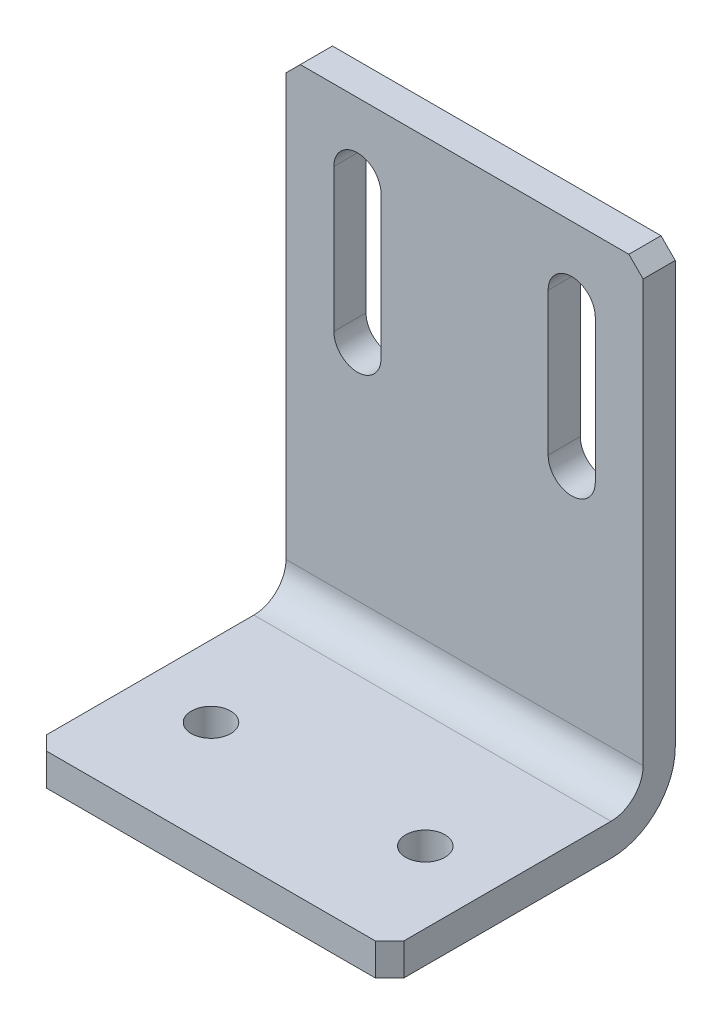
ISO-10303-21;
HEADER;
FILE_DESCRIPTION(('STEP AP214'),'2;1');
FILE_NAME('part.step','',(''),(''),'','','');
FILE_SCHEMA(('AUTOMOTIVE_DESIGN { 1 0 10303 214 1 1 1 1 }'));
ENDSEC;
DATA;
#1=APPLICATION_CONTEXT('core data for automotive mechanical design processes');
#2=APPLICATION_PROTOCOL_DEFINITION('international standard','automotive_design',2000,#1);
#3=PRODUCT_CONTEXT('',#1,'mechanical');
#4=PRODUCT('Part','Part','',(#3));
#5=PRODUCT_RELATED_PRODUCT_CATEGORY('part','',(#4));
#6=PRODUCT_DEFINITION_FORMATION('','',#4);
#7=PRODUCT_DEFINITION_CONTEXT('part definition',#1,'design');
#8=PRODUCT_DEFINITION('design','',#6,#7);
#9=PRODUCT_DEFINITION_SHAPE('','',#8);
#10=(LENGTH_UNIT() NAMED_UNIT(*) SI_UNIT(.MILLI.,.METRE.));
#11=(NAMED_UNIT(*) PLANE_ANGLE_UNIT() SI_UNIT($,.RADIAN.));
#12=(NAMED_UNIT(*) SI_UNIT($,.STERADIAN.) SOLID_ANGLE_UNIT());
#13=UNCERTAINTY_MEASURE_WITH_UNIT(LENGTH_MEASURE(1.E-05),#10,'distance_accuracy_value','');
#14=(GEOMETRIC_REPRESENTATION_CONTEXT(3) GLOBAL_UNCERTAINTY_ASSIGNED_CONTEXT((#13)) GLOBAL_UNIT_ASSIGNED_CONTEXT((#10,
#11,#12)) REPRESENTATION_CONTEXT('',''));
#15=CARTESIAN_POINT('',(0.,0.,0.));
#16=DIRECTION('',(0.,0.,1.));
#17=DIRECTION('',(1.,0.,0.));
#18=AXIS2_PLACEMENT_3D('',#15,#16,#17);
#19=CARTESIAN_POINT('',(25.,4.5,4.5));
#20=DIRECTION('',(0.,0.,-1.));
#21=DIRECTION('',(0.,1.,0.));
#22=AXIS2_PLACEMENT_3D('',#19,#20,#21);
#23=PLANE('',#22);
#24=DIRECTION('',(0.,-1.,0.));
#25=VECTOR('',#24,1.);
#26=CARTESIAN_POINT('',(11.7,60.,4.5));
#27=LINE('',#26,#25);
#28=CARTESIAN_POINT('',(11.7,60.,4.5));
#29=VERTEX_POINT('',#28);
#30=CARTESIAN_POINT('',(11.7,40.,4.5));
#31=VERTEX_POINT('',#30);
#32=EDGE_CURVE('E208',#29,#31,#27,.T.);
#33=ORIENTED_EDGE('',*,*,#32,.F.);
#34=CARTESIAN_POINT('',(15.,60.,4.5));
#35=DIRECTION('',(0.,0.,1.));
#36=DIRECTION('',(1.,0.,0.));
#37=AXIS2_PLACEMENT_3D('',#34,#35,#36);
#38=CIRCLE('',#37,3.30000000000001);
#39=CARTESIAN_POINT('',(18.3,60.,4.5));
#40=VERTEX_POINT('',#39);
#41=EDGE_CURVE('E181',#40,#29,#38,.T.);
#42=ORIENTED_EDGE('',*,*,#41,.F.);
#43=DIRECTION('',(0.,1.,0.));
#44=VECTOR('',#43,1.);
#45=CARTESIAN_POINT('',(18.3,60.,4.5));
#46=LINE('',#45,#44);
#47=CARTESIAN_POINT('',(18.3,40.,4.5));
#48=VERTEX_POINT('',#47);
#49=EDGE_CURVE('E199',#48,#40,#46,.T.);
#50=ORIENTED_EDGE('',*,*,#49,.F.);
#51=CARTESIAN_POINT('',(15.,40.,4.5));
#52=DIRECTION('',(0.,0.,1.));
#53=DIRECTION('',(1.,0.,0.));
#54=AXIS2_PLACEMENT_3D('',#51,#52,#53);
#55=CIRCLE('',#54,3.30000000000001);
#56=EDGE_CURVE('E202',#31,#48,#55,.T.);
#57=ORIENTED_EDGE('',*,*,#56,.F.);
#58=EDGE_LOOP('',(#33,#42,#50,#57));
#59=FACE_BOUND('',#58,.T.);
#60=DIRECTION('',(0.,-1.,0.));
#61=VECTOR('',#60,1.);
#62=CARTESIAN_POINT('',(-18.3,60.,4.5));
#63=LINE('',#62,#61);
#64=CARTESIAN_POINT('',(-18.3,60.,4.5));
#65=VERTEX_POINT('',#64);
#66=CARTESIAN_POINT('',(-18.3,40.,4.5));
#67=VERTEX_POINT('',#66);
#68=EDGE_CURVE('E233',#65,#67,#63,.T.);
#69=ORIENTED_EDGE('',*,*,#68,.F.);
#70=CARTESIAN_POINT('',(-15.,60.,4.5));
#71=DIRECTION('',(0.,0.,1.));
#72=DIRECTION('',(1.,0.,0.));
#73=AXIS2_PLACEMENT_3D('',#70,#71,#72);
#74=CIRCLE('',#73,3.3);
#75=CARTESIAN_POINT('',(-11.7,60.,4.5));
#76=VERTEX_POINT('',#75);
#77=EDGE_CURVE('E214',#76,#65,#74,.T.);
#78=ORIENTED_EDGE('',*,*,#77,.F.);
#79=DIRECTION('',(0.,1.,0.));
#80=VECTOR('',#79,1.);
#81=CARTESIAN_POINT('',(-11.7,60.,4.5));
#82=LINE('',#81,#80);
#83=CARTESIAN_POINT('',(-11.7,40.,4.5));
#84=VERTEX_POINT('',#83);
#85=EDGE_CURVE('E222',#84,#76,#82,.T.);
#86=ORIENTED_EDGE('',*,*,#85,.F.);
#87=CARTESIAN_POINT('',(-15.,40.,4.5));
#88=DIRECTION('',(0.,0.,1.));
#89=DIRECTION('',(1.,0.,0.));
#90=AXIS2_PLACEMENT_3D('',#87,#88,#89);
#91=CIRCLE('',#90,3.3);
#92=EDGE_CURVE('E236',#67,#84,#91,.T.);
#93=ORIENTED_EDGE('',*,*,#92,.F.);
#94=EDGE_LOOP('',(#69,#78,#86,#93));
#95=FACE_BOUND('',#94,.T.);
#96=DIRECTION('',(0.,-1.,0.));
#97=VECTOR('',#96,1.);
#98=CARTESIAN_POINT('',(25.,4.5,4.5));
#99=LINE('',#98,#97);
#100=CARTESIAN_POINT('',(25.,68.,4.5));
#101=VERTEX_POINT('',#100);
#102=CARTESIAN_POINT('',(25.,9.,4.5));
#103=VERTEX_POINT('',#102);
#104=EDGE_CURVE('E262',#101,#103,#99,.T.);
#105=ORIENTED_EDGE('',*,*,#104,.F.);
#106=DIRECTION('',(-0.70710678118655,0.707106781186545,0.));
#107=VECTOR('',#106,1.);
#108=CARTESIAN_POINT('',(25.,68.,4.5));
#109=LINE('',#108,#107);
#110=CARTESIAN_POINT('',(23.,70.,4.5));
#111=VERTEX_POINT('',#110);
#112=EDGE_CURVE('E338',#101,#111,#109,.T.);
#113=ORIENTED_EDGE('',*,*,#112,.T.);
#114=DIRECTION('',(-1.,0.,0.));
#115=VECTOR('',#114,1.);
#116=CARTESIAN_POINT('',(25.,70.,4.5));
#117=LINE('',#116,#115);
#118=CARTESIAN_POINT('',(-23.,70.,4.5));
#119=VERTEX_POINT('',#118);
#120=EDGE_CURVE('E273',#111,#119,#117,.T.);
#121=ORIENTED_EDGE('',*,*,#120,.T.);
#122=DIRECTION('',(0.707106781186545,0.70710678118655,0.));
#123=VECTOR('',#122,1.);
#124=CARTESIAN_POINT('',(-23.,70.,4.5));
#125=LINE('',#124,#123);
#126=CARTESIAN_POINT('',(-25.,68.,4.5));
#127=VERTEX_POINT('',#126);
#128=EDGE_CURVE('E336',#119,#127,#125,.F.);
#129=ORIENTED_EDGE('',*,*,#128,.T.);
#130=DIRECTION('',(0.,-1.,0.));
#131=VECTOR('',#130,1.);
#132=CARTESIAN_POINT('',(-25.,4.5,4.5));
#133=LINE('',#132,#131);
#134=CARTESIAN_POINT('',(-25.,9.,4.5));
#135=VERTEX_POINT('',#134);
#136=EDGE_CURVE('E261',#127,#135,#133,.T.);
#137=ORIENTED_EDGE('',*,*,#136,.T.);
#138=DIRECTION('',(-1.,0.,0.));
#139=VECTOR('',#138,1.);
#140=CARTESIAN_POINT('',(25.,9.,4.5));
#141=LINE('',#140,#139);
#142=EDGE_CURVE('E294',#135,#103,#141,.F.);
#143=ORIENTED_EDGE('',*,*,#142,.T.);
#144=EDGE_LOOP('',(#105,#113,#121,#129,#137,#143));
#145=FACE_BOUND('',#144,.T.);
#146=ADVANCED_FACE('F37',(#59,#95,#145),#23,.F.);
#147=CARTESIAN_POINT('',(25.,4.5,4.5));
#148=DIRECTION('',(0.,-1.,0.));
#149=DIRECTION('',(0.,0.,-1.));
#150=AXIS2_PLACEMENT_3D('',#147,#148,#149);
#151=PLANE('',#150);
#152=CARTESIAN_POINT('',(-15.,4.5,25.));
#153=DIRECTION('',(0.,1.,0.));
#154=DIRECTION('',(0.,0.,1.));
#155=AXIS2_PLACEMENT_3D('',#152,#153,#154);
#156=CIRCLE('',#155,2.75);
#157=CARTESIAN_POINT('',(-15.,4.5,27.75));
#158=VERTEX_POINT('',#157);
#159=EDGE_CURVE('E243',#158,#158,#156,.T.);
#160=ORIENTED_EDGE('',*,*,#159,.F.);
#161=EDGE_LOOP('',(#160));
#162=FACE_BOUND('',#161,.T.);
#163=CARTESIAN_POINT('',(15.,4.5,25.));
#164=DIRECTION('',(0.,1.,0.));
#165=DIRECTION('',(0.,0.,1.));
#166=AXIS2_PLACEMENT_3D('',#163,#164,#165);
#167=CIRCLE('',#166,2.75);
#168=CARTESIAN_POINT('',(15.,4.5,27.75));
#169=VERTEX_POINT('',#168);
#170=EDGE_CURVE('E255',#169,#169,#167,.T.);
#171=ORIENTED_EDGE('',*,*,#170,.F.);
#172=EDGE_LOOP('',(#171));
#173=FACE_BOUND('',#172,.T.);
#174=DIRECTION('',(0.,0.,1.));
#175=VECTOR('',#174,1.);
#176=CARTESIAN_POINT('',(-25.,4.5,4.5));
#177=LINE('',#176,#175);
#178=CARTESIAN_POINT('',(-25.,4.5,9.));
#179=VERTEX_POINT('',#178);
#180=CARTESIAN_POINT('',(-25.,4.5,38.));
#181=VERTEX_POINT('',#180);
#182=EDGE_CURVE('E275',#179,#181,#177,.T.);
#183=ORIENTED_EDGE('',*,*,#182,.T.);
#184=DIRECTION('',(-0.707106781186547,0.,-0.707106781186548));
#185=VECTOR('',#184,1.);
#186=CARTESIAN_POINT('',(-23.,4.5,40.));
#187=LINE('',#186,#185);
#188=CARTESIAN_POINT('',(-23.,4.5,40.));
#189=VERTEX_POINT('',#188);
#190=EDGE_CURVE('E328',#181,#189,#187,.F.);
#191=ORIENTED_EDGE('',*,*,#190,.T.);
#192=DIRECTION('',(-1.,0.,0.));
#193=VECTOR('',#192,1.);
#194=CARTESIAN_POINT('',(25.,4.5,40.));
#195=LINE('',#194,#193);
#196=CARTESIAN_POINT('',(23.,4.5,40.));
#197=VERTEX_POINT('',#196);
#198=EDGE_CURVE('E288',#197,#189,#195,.T.);
#199=ORIENTED_EDGE('',*,*,#198,.F.);
#200=DIRECTION('',(0.707106781186552,0.,-0.707106781186543));
#201=VECTOR('',#200,1.);
#202=CARTESIAN_POINT('',(25.,4.5,38.));
#203=LINE('',#202,#201);
#204=CARTESIAN_POINT('',(25.,4.5,38.));
#205=VERTEX_POINT('',#204);
#206=EDGE_CURVE('E326',#197,#205,#203,.T.);
#207=ORIENTED_EDGE('',*,*,#206,.T.);
#208=DIRECTION('',(0.,0.,1.));
#209=VECTOR('',#208,1.);
#210=CARTESIAN_POINT('',(25.,4.5,4.5));
#211=LINE('',#210,#209);
#212=CARTESIAN_POINT('',(25.,4.5,9.));
#213=VERTEX_POINT('',#212);
#214=EDGE_CURVE('E264',#213,#205,#211,.T.);
#215=ORIENTED_EDGE('',*,*,#214,.F.);
#216=DIRECTION('',(-1.,0.,0.));
#217=VECTOR('',#216,1.);
#218=CARTESIAN_POINT('',(-25.,4.5,9.));
#219=LINE('',#218,#217);
#220=EDGE_CURVE('E291',#213,#179,#219,.T.);
#221=ORIENTED_EDGE('',*,*,#220,.T.);
#222=EDGE_LOOP('',(#183,#191,#199,#207,#215,#221));
#223=FACE_BOUND('',#222,.T.);
#224=ADVANCED_FACE('F373',(#162,#173,#223),#151,.F.);
#225=CARTESIAN_POINT('',(25.,0.,40.));
#226=DIRECTION('',(0.,0.,-1.));
#227=DIRECTION('',(0.,1.,0.));
#228=AXIS2_PLACEMENT_3D('',#225,#226,#227);
#229=PLANE('',#228);
#230=ORIENTED_EDGE('',*,*,#198,.T.);
#231=DIRECTION('',(0.,-1.,0.));
#232=VECTOR('',#231,1.);
#233=CARTESIAN_POINT('',(-23.,0.,40.));
#234=LINE('',#233,#232);
#235=CARTESIAN_POINT('',(-23.,0.,40.));
#236=VERTEX_POINT('',#235);
#237=EDGE_CURVE('E315',#189,#236,#234,.T.);
#238=ORIENTED_EDGE('',*,*,#237,.T.);
#239=DIRECTION('',(-1.,0.,0.));
#240=VECTOR('',#239,1.);
#241=CARTESIAN_POINT('',(25.,0.,40.));
#242=LINE('',#241,#240);
#243=CARTESIAN_POINT('',(23.,0.,40.));
#244=VERTEX_POINT('',#243);
#245=EDGE_CURVE('E285',#244,#236,#242,.T.);
#246=ORIENTED_EDGE('',*,*,#245,.F.);
#247=DIRECTION('',(0.,1.,0.));
#248=VECTOR('',#247,1.);
#249=CARTESIAN_POINT('',(23.,4.5,40.));
#250=LINE('',#249,#248);
#251=EDGE_CURVE('E313',#244,#197,#250,.T.);
#252=ORIENTED_EDGE('',*,*,#251,.T.);
#253=EDGE_LOOP('',(#230,#238,#246,#252));
#254=FACE_BOUND('',#253,.T.);
#255=ADVANCED_FACE('F380',(#254),#229,.F.);
#256=CARTESIAN_POINT('',(25.,0.,0.));
#257=DIRECTION('',(0.,1.,0.));
#258=DIRECTION('',(0.,0.,1.));
#259=AXIS2_PLACEMENT_3D('',#256,#257,#258);
#260=PLANE('',#259);
#261=CARTESIAN_POINT('',(-15.,0.,25.));
#262=DIRECTION('',(0.,1.,0.));
#263=DIRECTION('',(0.,0.,1.));
#264=AXIS2_PLACEMENT_3D('',#261,#262,#263);
#265=CIRCLE('',#264,2.75);
#266=CARTESIAN_POINT('',(-15.,0.,27.75));
#267=VERTEX_POINT('',#266);
#268=EDGE_CURVE('E252',#267,#267,#265,.T.);
#269=ORIENTED_EDGE('',*,*,#268,.T.);
#270=EDGE_LOOP('',(#269));
#271=FACE_BOUND('',#270,.T.);
#272=CARTESIAN_POINT('',(15.,0.,25.));
#273=DIRECTION('',(0.,1.,0.));
#274=DIRECTION('',(0.,0.,1.));
#275=AXIS2_PLACEMENT_3D('',#272,#273,#274);
#276=CIRCLE('',#275,2.75);
#277=CARTESIAN_POINT('',(15.,0.,27.75));
#278=VERTEX_POINT('',#277);
#279=EDGE_CURVE('E258',#278,#278,#276,.T.);
#280=ORIENTED_EDGE('',*,*,#279,.T.);
#281=EDGE_LOOP('',(#280));
#282=FACE_BOUND('',#281,.T.);
#283=ORIENTED_EDGE('',*,*,#245,.T.);
#284=DIRECTION('',(0.707106781186547,0.,0.707106781186548));
#285=VECTOR('',#284,1.);
#286=CARTESIAN_POINT('',(-23.,0.,40.));
#287=LINE('',#286,#285);
#288=CARTESIAN_POINT('',(-25.,0.,38.));
#289=VERTEX_POINT('',#288);
#290=EDGE_CURVE('E320',#236,#289,#287,.F.);
#291=ORIENTED_EDGE('',*,*,#290,.T.);
#292=DIRECTION('',(0.,0.,-1.));
#293=VECTOR('',#292,1.);
#294=CARTESIAN_POINT('',(-25.,0.,0.));
#295=LINE('',#294,#293);
#296=CARTESIAN_POINT('',(-25.,0.,9.));
#297=VERTEX_POINT('',#296);
#298=EDGE_CURVE('E278',#289,#297,#295,.T.);
#299=ORIENTED_EDGE('',*,*,#298,.T.);
#300=DIRECTION('',(-1.,0.,0.));
#301=VECTOR('',#300,1.);
#302=CARTESIAN_POINT('',(25.,0.,9.));
#303=LINE('',#302,#301);
#304=CARTESIAN_POINT('',(25.,0.,9.));
#305=VERTEX_POINT('',#304);
#306=EDGE_CURVE('E308',#297,#305,#303,.F.);
#307=ORIENTED_EDGE('',*,*,#306,.T.);
#308=DIRECTION('',(0.,0.,-1.));
#309=VECTOR('',#308,1.);
#310=CARTESIAN_POINT('',(25.,0.,0.));
#311=LINE('',#310,#309);
#312=CARTESIAN_POINT('',(25.,0.,38.));
#313=VERTEX_POINT('',#312);
#314=EDGE_CURVE('E268',#313,#305,#311,.T.);
#315=ORIENTED_EDGE('',*,*,#314,.F.);
#316=DIRECTION('',(-0.707106781186552,0.,0.707106781186543));
#317=VECTOR('',#316,1.);
#318=CARTESIAN_POINT('',(25.,0.,38.));
#319=LINE('',#318,#317);
#320=EDGE_CURVE('E318',#313,#244,#319,.T.);
#321=ORIENTED_EDGE('',*,*,#320,.T.);
#322=EDGE_LOOP('',(#283,#291,#299,#307,#315,#321));
#323=FACE_BOUND('',#322,.T.);
#324=ADVANCED_FACE('F417',(#271,#282,#323),#260,.F.);
#325=CARTESIAN_POINT('',(25.,0.,0.));
#326=DIRECTION('',(0.,0.,1.));
#327=DIRECTION('',(1.,0.,0.));
#328=AXIS2_PLACEMENT_3D('',#325,#326,#327);
#329=PLANE('',#328);
#330=DIRECTION('',(0.,1.,0.));
#331=VECTOR('',#330,1.);
#332=CARTESIAN_POINT('',(18.3,60.,0.));
#333=LINE('',#332,#331);
#334=CARTESIAN_POINT('',(18.3,40.,0.));
#335=VERTEX_POINT('',#334);
#336=CARTESIAN_POINT('',(18.3,60.,0.));
#337=VERTEX_POINT('',#336);
#338=EDGE_CURVE('E186',#335,#337,#333,.T.);
#339=ORIENTED_EDGE('',*,*,#338,.T.);
#340=CARTESIAN_POINT('',(15.,60.,0.));
#341=DIRECTION('',(0.,0.,1.));
#342=DIRECTION('',(1.,0.,0.));
#343=AXIS2_PLACEMENT_3D('',#340,#341,#342);
#344=CIRCLE('',#343,3.30000000000001);
#345=CARTESIAN_POINT('',(11.7,60.,0.));
#346=VERTEX_POINT('',#345);
#347=EDGE_CURVE('E178',#337,#346,#344,.T.);
#348=ORIENTED_EDGE('',*,*,#347,.T.);
#349=DIRECTION('',(0.,-1.,0.));
#350=VECTOR('',#349,1.);
#351=CARTESIAN_POINT('',(11.7,60.,0.));
#352=LINE('',#351,#350);
#353=CARTESIAN_POINT('',(11.7,40.,0.));
#354=VERTEX_POINT('',#353);
#355=EDGE_CURVE('E190',#346,#354,#352,.T.);
#356=ORIENTED_EDGE('',*,*,#355,.T.);
#357=CARTESIAN_POINT('',(15.,40.,0.));
#358=DIRECTION('',(0.,0.,1.));
#359=DIRECTION('',(1.,0.,0.));
#360=AXIS2_PLACEMENT_3D('',#357,#358,#359);
#361=CIRCLE('',#360,3.30000000000001);
#362=EDGE_CURVE('E194',#354,#335,#361,.T.);
#363=ORIENTED_EDGE('',*,*,#362,.T.);
#364=EDGE_LOOP('',(#339,#348,#356,#363));
#365=FACE_BOUND('',#364,.T.);
#366=DIRECTION('',(0.,1.,0.));
#367=VECTOR('',#366,1.);
#368=CARTESIAN_POINT('',(-11.7,60.,0.));
#369=LINE('',#368,#367);
#370=CARTESIAN_POINT('',(-11.7,40.,0.));
#371=VERTEX_POINT('',#370);
#372=CARTESIAN_POINT('',(-11.7,60.,0.));
#373=VERTEX_POINT('',#372);
#374=EDGE_CURVE('E228',#371,#373,#369,.T.);
#375=ORIENTED_EDGE('',*,*,#374,.T.);
#376=CARTESIAN_POINT('',(-15.,60.,0.));
#377=DIRECTION('',(0.,0.,1.));
#378=DIRECTION('',(1.,0.,0.));
#379=AXIS2_PLACEMENT_3D('',#376,#377,#378);
#380=CIRCLE('',#379,3.3);
#381=CARTESIAN_POINT('',(-18.3,60.,0.));
#382=VERTEX_POINT('',#381);
#383=EDGE_CURVE('E218',#373,#382,#380,.T.);
#384=ORIENTED_EDGE('',*,*,#383,.T.);
#385=DIRECTION('',(0.,-1.,0.));
#386=VECTOR('',#385,1.);
#387=CARTESIAN_POINT('',(-18.3,60.,0.));
#388=LINE('',#387,#386);
#389=CARTESIAN_POINT('',(-18.3,40.,0.));
#390=VERTEX_POINT('',#389);
#391=EDGE_CURVE('E221',#382,#390,#388,.T.);
#392=ORIENTED_EDGE('',*,*,#391,.T.);
#393=CARTESIAN_POINT('',(-15.,40.,0.));
#394=DIRECTION('',(0.,0.,1.));
#395=DIRECTION('',(1.,0.,0.));
#396=AXIS2_PLACEMENT_3D('',#393,#394,#395);
#397=CIRCLE('',#396,3.3);
#398=EDGE_CURVE('E225',#390,#371,#397,.T.);
#399=ORIENTED_EDGE('',*,*,#398,.T.);
#400=EDGE_LOOP('',(#375,#384,#392,#399));
#401=FACE_BOUND('',#400,.T.);
#402=DIRECTION('',(-1.,0.,0.));
#403=VECTOR('',#402,1.);
#404=CARTESIAN_POINT('',(25.,70.,0.));
#405=LINE('',#404,#403);
#406=CARTESIAN_POINT('',(23.,70.,0.));
#407=VERTEX_POINT('',#406);
#408=CARTESIAN_POINT('',(-23.,70.,0.));
#409=VERTEX_POINT('',#408);
#410=EDGE_CURVE('E283',#407,#409,#405,.T.);
#411=ORIENTED_EDGE('',*,*,#410,.F.);
#412=DIRECTION('',(0.70710678118655,-0.707106781186545,0.));
#413=VECTOR('',#412,1.);
#414=CARTESIAN_POINT('',(25.,68.,0.));
#415=LINE('',#414,#413);
#416=CARTESIAN_POINT('',(25.,68.,0.));
#417=VERTEX_POINT('',#416);
#418=EDGE_CURVE('E11',#407,#417,#415,.T.);
#419=ORIENTED_EDGE('',*,*,#418,.T.);
#420=DIRECTION('',(0.,1.,0.));
#421=VECTOR('',#420,1.);
#422=CARTESIAN_POINT('',(25.,0.,0.));
#423=LINE('',#422,#421);
#424=CARTESIAN_POINT('',(25.,9.,0.));
#425=VERTEX_POINT('',#424);
#426=EDGE_CURVE('E270',#425,#417,#423,.T.);
#427=ORIENTED_EDGE('',*,*,#426,.F.);
#428=DIRECTION('',(-1.,0.,0.));
#429=VECTOR('',#428,1.);
#430=CARTESIAN_POINT('',(25.,9.,0.));
#431=LINE('',#430,#429);
#432=CARTESIAN_POINT('',(-25.,9.,0.));
#433=VERTEX_POINT('',#432);
#434=EDGE_CURVE('E302',#425,#433,#431,.T.);
#435=ORIENTED_EDGE('',*,*,#434,.T.);
#436=DIRECTION('',(0.,1.,0.));
#437=VECTOR('',#436,1.);
#438=CARTESIAN_POINT('',(-25.,0.,0.));
#439=LINE('',#438,#437);
#440=CARTESIAN_POINT('',(-25.,67.9999999999999,0.));
#441=VERTEX_POINT('',#440);
#442=EDGE_CURVE('E265',#433,#441,#439,.T.);
#443=ORIENTED_EDGE('',*,*,#442,.T.);
#444=DIRECTION('',(-0.707106781186545,-0.70710678118655,0.));
#445=VECTOR('',#444,1.);
#446=CARTESIAN_POINT('',(-23.,70.,0.));
#447=LINE('',#446,#445);
#448=EDGE_CURVE('E45',#441,#409,#447,.F.);
#449=ORIENTED_EDGE('',*,*,#448,.T.);
#450=EDGE_LOOP('',(#411,#419,#427,#435,#443,#449));
#451=FACE_BOUND('',#450,.T.);
#452=ADVANCED_FACE('F196',(#365,#401,#451),#329,.F.);
#453=CARTESIAN_POINT('',(25.,70.,0.));
#454=DIRECTION('',(0.,-1.,0.));
#455=DIRECTION('',(0.,0.,-1.));
#456=AXIS2_PLACEMENT_3D('',#453,#454,#455);
#457=PLANE('',#456);
#458=ORIENTED_EDGE('',*,*,#120,.F.);
#459=DIRECTION('',(0.,0.,-1.));
#460=VECTOR('',#459,1.);
#461=CARTESIAN_POINT('',(23.,70.,0.));
#462=LINE('',#461,#460);
#463=EDGE_CURVE('E58',#111,#407,#462,.T.);
#464=ORIENTED_EDGE('',*,*,#463,.T.);
#465=ORIENTED_EDGE('',*,*,#410,.T.);
#466=DIRECTION('',(0.,0.,1.));
#467=VECTOR('',#466,1.);
#468=CARTESIAN_POINT('',(-23.,70.,0.));
#469=LINE('',#468,#467);
#470=EDGE_CURVE('E340',#409,#119,#469,.T.);
#471=ORIENTED_EDGE('',*,*,#470,.T.);
#472=EDGE_LOOP('',(#458,#464,#465,#471));
#473=FACE_BOUND('',#472,.T.);
#474=ADVANCED_FACE('F344',(#473),#457,.F.);
#475=CARTESIAN_POINT('',(25.,70.,4.5));
#476=DIRECTION('',(1.,0.,0.));
#477=DIRECTION('',(0.,0.,-1.));
#478=AXIS2_PLACEMENT_3D('',#475,#476,#477);
#479=PLANE('',#478);
#480=ORIENTED_EDGE('',*,*,#214,.T.);
#481=DIRECTION('',(0.,-1.,0.));
#482=VECTOR('',#481,1.);
#483=CARTESIAN_POINT('',(25.,0.,38.));
#484=LINE('',#483,#482);
#485=EDGE_CURVE('E333',#205,#313,#484,.T.);
#486=ORIENTED_EDGE('',*,*,#485,.T.);
#487=ORIENTED_EDGE('',*,*,#314,.T.);
#488=CARTESIAN_POINT('',(25.,9.,9.));
#489=DIRECTION('',(1.,0.,0.));
#490=DIRECTION('',(0.,0.,-1.));
#491=AXIS2_PLACEMENT_3D('',#488,#489,#490);
#492=CIRCLE('',#491,9.);
#493=EDGE_CURVE('E311',#305,#425,#492,.T.);
#494=ORIENTED_EDGE('',*,*,#493,.T.);
#495=ORIENTED_EDGE('',*,*,#426,.T.);
#496=DIRECTION('',(0.,0.,1.));
#497=VECTOR('',#496,1.);
#498=CARTESIAN_POINT('',(25.,68.,4.5));
#499=LINE('',#498,#497);
#500=EDGE_CURVE('E330',#417,#101,#499,.T.);
#501=ORIENTED_EDGE('',*,*,#500,.T.);
#502=ORIENTED_EDGE('',*,*,#104,.T.);
#503=CARTESIAN_POINT('',(25.,9.,9.));
#504=DIRECTION('',(1.,0.,0.));
#505=DIRECTION('',(0.,0.,-1.));
#506=AXIS2_PLACEMENT_3D('',#503,#504,#505);
#507=CIRCLE('',#506,4.5);
#508=EDGE_CURVE('E300',#103,#213,#507,.F.);
#509=ORIENTED_EDGE('',*,*,#508,.T.);
#510=EDGE_LOOP('',(#480,#486,#487,#494,#495,#501,#502,#509));
#511=FACE_BOUND('',#510,.T.);
#512=ADVANCED_FACE('F354',(#511),#479,.T.);
#513=CARTESIAN_POINT('',(-25.,70.,4.5));
#514=DIRECTION('',(1.,0.,0.));
#515=DIRECTION('',(0.,0.,-1.));
#516=AXIS2_PLACEMENT_3D('',#513,#514,#515);
#517=PLANE('',#516);
#518=ORIENTED_EDGE('',*,*,#298,.F.);
#519=DIRECTION('',(0.,1.,0.));
#520=VECTOR('',#519,1.);
#521=CARTESIAN_POINT('',(-25.,70.,38.0000000000001));
#522=LINE('',#521,#520);
#523=EDGE_CURVE('E324',#289,#181,#522,.T.);
#524=ORIENTED_EDGE('',*,*,#523,.T.);
#525=ORIENTED_EDGE('',*,*,#182,.F.);
#526=CARTESIAN_POINT('',(-25.,9.,9.));
#527=DIRECTION('',(1.,0.,0.));
#528=DIRECTION('',(0.,0.,-1.));
#529=AXIS2_PLACEMENT_3D('',#526,#527,#528);
#530=CIRCLE('',#529,4.5);
#531=EDGE_CURVE('E297',#179,#135,#530,.T.);
#532=ORIENTED_EDGE('',*,*,#531,.T.);
#533=ORIENTED_EDGE('',*,*,#136,.F.);
#534=DIRECTION('',(0.,0.,-1.));
#535=VECTOR('',#534,1.);
#536=CARTESIAN_POINT('',(-25.,68.,4.5));
#537=LINE('',#536,#535);
#538=EDGE_CURVE('E322',#127,#441,#537,.T.);
#539=ORIENTED_EDGE('',*,*,#538,.T.);
#540=ORIENTED_EDGE('',*,*,#442,.F.);
#541=CARTESIAN_POINT('',(-25.,9.,9.));
#542=DIRECTION('',(1.,0.,0.));
#543=DIRECTION('',(0.,0.,-1.));
#544=AXIS2_PLACEMENT_3D('',#541,#542,#543);
#545=CIRCLE('',#544,9.);
#546=EDGE_CURVE('E305',#433,#297,#545,.F.);
#547=ORIENTED_EDGE('',*,*,#546,.T.);
#548=EDGE_LOOP('',(#518,#524,#525,#532,#533,#539,#540,#547));
#549=FACE_BOUND('',#548,.T.);
#550=ADVANCED_FACE('F364',(#549),#517,.F.);
#551=CARTESIAN_POINT('',(25.,9.,9.));
#552=DIRECTION('',(1.,0.,0.));
#553=DIRECTION('',(0.,0.,-1.));
#554=AXIS2_PLACEMENT_3D('',#551,#552,#553);
#555=CYLINDRICAL_SURFACE('',#554,4.5);
#556=ORIENTED_EDGE('',*,*,#508,.F.);
#557=ORIENTED_EDGE('',*,*,#142,.F.);
#558=ORIENTED_EDGE('',*,*,#531,.F.);
#559=ORIENTED_EDGE('',*,*,#220,.F.);
#560=EDGE_LOOP('',(#556,#557,#558,#559));
#561=FACE_BOUND('',#560,.T.);
#562=ADVANCED_FACE('F386',(#561),#555,.F.);
#563=CARTESIAN_POINT('',(25.,9.,9.));
#564=DIRECTION('',(-1.,0.,0.));
#565=DIRECTION('',(0.,0.,1.));
#566=AXIS2_PLACEMENT_3D('',#563,#564,#565);
#567=CYLINDRICAL_SURFACE('',#566,9.);
#568=ORIENTED_EDGE('',*,*,#493,.F.);
#569=ORIENTED_EDGE('',*,*,#306,.F.);
#570=ORIENTED_EDGE('',*,*,#546,.F.);
#571=ORIENTED_EDGE('',*,*,#434,.F.);
#572=EDGE_LOOP('',(#568,#569,#570,#571));
#573=FACE_BOUND('',#572,.T.);
#574=ADVANCED_FACE('F360',(#573),#567,.T.);
#575=CARTESIAN_POINT('',(15.,4.5,25.));
#576=DIRECTION('',(0.,1.,0.));
#577=DIRECTION('',(0.,0.,1.));
#578=AXIS2_PLACEMENT_3D('',#575,#576,#577);
#579=CYLINDRICAL_SURFACE('',#578,2.75);
#580=ORIENTED_EDGE('',*,*,#279,.F.);
#581=EDGE_LOOP('',(#580));
#582=FACE_BOUND('',#581,.T.);
#583=ORIENTED_EDGE('',*,*,#170,.T.);
#584=EDGE_LOOP('',(#583));
#585=FACE_BOUND('',#584,.T.);
#586=ADVANCED_FACE('F392',(#582,#585),#579,.F.);
#587=CARTESIAN_POINT('',(-15.,4.5,25.));
#588=DIRECTION('',(0.,1.,0.));
#589=DIRECTION('',(0.,0.,1.));
#590=AXIS2_PLACEMENT_3D('',#587,#588,#589);
#591=CYLINDRICAL_SURFACE('',#590,2.75);
#592=ORIENTED_EDGE('',*,*,#268,.F.);
#593=EDGE_LOOP('',(#592));
#594=FACE_BOUND('',#593,.T.);
#595=ORIENTED_EDGE('',*,*,#159,.T.);
#596=EDGE_LOOP('',(#595));
#597=FACE_BOUND('',#596,.T.);
#598=ADVANCED_FACE('F436',(#594,#597),#591,.F.);
#599=CARTESIAN_POINT('',(-15.,60.,0.));
#600=DIRECTION('',(0.,0.,1.));
#601=DIRECTION('',(1.,0.,0.));
#602=AXIS2_PLACEMENT_3D('',#599,#600,#601);
#603=CYLINDRICAL_SURFACE('',#602,3.3);
#604=ORIENTED_EDGE('',*,*,#77,.T.);
#605=DIRECTION('',(0.,0.,1.));
#606=VECTOR('',#605,1.);
#607=CARTESIAN_POINT('',(-18.3,60.,0.));
#608=LINE('',#607,#606);
#609=EDGE_CURVE('E231',#382,#65,#608,.T.);
#610=ORIENTED_EDGE('',*,*,#609,.F.);
#611=ORIENTED_EDGE('',*,*,#383,.F.);
#612=DIRECTION('',(0.,0.,1.));
#613=VECTOR('',#612,1.);
#614=CARTESIAN_POINT('',(-11.7,60.,0.));
#615=LINE('',#614,#613);
#616=EDGE_CURVE('E241',#373,#76,#615,.T.);
#617=ORIENTED_EDGE('',*,*,#616,.T.);
#618=EDGE_LOOP('',(#604,#610,#611,#617));
#619=FACE_BOUND('',#618,.T.);
#620=ADVANCED_FACE('F440',(#619),#603,.F.);
#621=CARTESIAN_POINT('',(-11.7,60.,0.));
#622=DIRECTION('',(1.,0.,0.));
#623=DIRECTION('',(0.,0.,-1.));
#624=AXIS2_PLACEMENT_3D('',#621,#622,#623);
#625=PLANE('',#624);
#626=ORIENTED_EDGE('',*,*,#85,.T.);
#627=ORIENTED_EDGE('',*,*,#616,.F.);
#628=ORIENTED_EDGE('',*,*,#374,.F.);
#629=DIRECTION('',(0.,0.,1.));
#630=VECTOR('',#629,1.);
#631=CARTESIAN_POINT('',(-11.7,40.,0.));
#632=LINE('',#631,#630);
#633=EDGE_CURVE('E244',#371,#84,#632,.T.);
#634=ORIENTED_EDGE('',*,*,#633,.T.);
#635=EDGE_LOOP('',(#626,#627,#628,#634));
#636=FACE_BOUND('',#635,.T.);
#637=ADVANCED_FACE('F444',(#636),#625,.F.);
#638=CARTESIAN_POINT('',(-15.,40.,0.));
#639=DIRECTION('',(0.,0.,1.));
#640=DIRECTION('',(1.,0.,0.));
#641=AXIS2_PLACEMENT_3D('',#638,#639,#640);
#642=CYLINDRICAL_SURFACE('',#641,3.3);
#643=ORIENTED_EDGE('',*,*,#92,.T.);
#644=ORIENTED_EDGE('',*,*,#633,.F.);
#645=ORIENTED_EDGE('',*,*,#398,.F.);
#646=DIRECTION('',(0.,0.,1.));
#647=VECTOR('',#646,1.);
#648=CARTESIAN_POINT('',(-18.3,40.,0.));
#649=LINE('',#648,#647);
#650=EDGE_CURVE('E246',#390,#67,#649,.T.);
#651=ORIENTED_EDGE('',*,*,#650,.T.);
#652=EDGE_LOOP('',(#643,#644,#645,#651));
#653=FACE_BOUND('',#652,.T.);
#654=ADVANCED_FACE('F449',(#653),#642,.F.);
#655=CARTESIAN_POINT('',(-18.3,60.,0.));
#656=DIRECTION('',(-1.,0.,0.));
#657=DIRECTION('',(0.,0.,1.));
#658=AXIS2_PLACEMENT_3D('',#655,#656,#657);
#659=PLANE('',#658);
#660=ORIENTED_EDGE('',*,*,#68,.T.);
#661=ORIENTED_EDGE('',*,*,#650,.F.);
#662=ORIENTED_EDGE('',*,*,#391,.F.);
#663=ORIENTED_EDGE('',*,*,#609,.T.);
#664=EDGE_LOOP('',(#660,#661,#662,#663));
#665=FACE_BOUND('',#664,.T.);
#666=ADVANCED_FACE('F446',(#665),#659,.F.);
#667=CARTESIAN_POINT('',(15.,60.,0.));
#668=DIRECTION('',(0.,0.,1.));
#669=DIRECTION('',(1.,0.,0.));
#670=AXIS2_PLACEMENT_3D('',#667,#668,#669);
#671=CYLINDRICAL_SURFACE('',#670,3.30000000000001);
#672=ORIENTED_EDGE('',*,*,#41,.T.);
#673=DIRECTION('',(0.,0.,1.));
#674=VECTOR('',#673,1.);
#675=CARTESIAN_POINT('',(11.7,60.,0.));
#676=LINE('',#675,#674);
#677=EDGE_CURVE('E174',#346,#29,#676,.T.);
#678=ORIENTED_EDGE('',*,*,#677,.F.);
#679=ORIENTED_EDGE('',*,*,#347,.F.);
#680=DIRECTION('',(0.,0.,1.));
#681=VECTOR('',#680,1.);
#682=CARTESIAN_POINT('',(18.3,60.,0.));
#683=LINE('',#682,#681);
#684=EDGE_CURVE('E212',#337,#40,#683,.T.);
#685=ORIENTED_EDGE('',*,*,#684,.T.);
#686=EDGE_LOOP('',(#672,#678,#679,#685));
#687=FACE_BOUND('',#686,.T.);
#688=ADVANCED_FACE('F176',(#687),#671,.F.);
#689=CARTESIAN_POINT('',(18.3,60.,0.));
#690=DIRECTION('',(1.,0.,0.));
#691=DIRECTION('',(0.,0.,-1.));
#692=AXIS2_PLACEMENT_3D('',#689,#690,#691);
#693=PLANE('',#692);
#694=ORIENTED_EDGE('',*,*,#49,.T.);
#695=ORIENTED_EDGE('',*,*,#684,.F.);
#696=ORIENTED_EDGE('',*,*,#338,.F.);
#697=DIRECTION('',(0.,0.,1.));
#698=VECTOR('',#697,1.);
#699=CARTESIAN_POINT('',(18.3,40.,0.));
#700=LINE('',#699,#698);
#701=EDGE_CURVE('E215',#335,#48,#700,.T.);
#702=ORIENTED_EDGE('',*,*,#701,.T.);
#703=EDGE_LOOP('',(#694,#695,#696,#702));
#704=FACE_BOUND('',#703,.T.);
#705=ADVANCED_FACE('F459',(#704),#693,.F.);
#706=CARTESIAN_POINT('',(15.,40.,0.));
#707=DIRECTION('',(0.,0.,1.));
#708=DIRECTION('',(1.,0.,0.));
#709=AXIS2_PLACEMENT_3D('',#706,#707,#708);
#710=CYLINDRICAL_SURFACE('',#709,3.30000000000001);
#711=ORIENTED_EDGE('',*,*,#56,.T.);
#712=ORIENTED_EDGE('',*,*,#701,.F.);
#713=ORIENTED_EDGE('',*,*,#362,.F.);
#714=DIRECTION('',(0.,0.,1.));
#715=VECTOR('',#714,1.);
#716=CARTESIAN_POINT('',(11.7,40.,0.));
#717=LINE('',#716,#715);
#718=EDGE_CURVE('E185',#354,#31,#717,.T.);
#719=ORIENTED_EDGE('',*,*,#718,.T.);
#720=EDGE_LOOP('',(#711,#712,#713,#719));
#721=FACE_BOUND('',#720,.T.);
#722=ADVANCED_FACE('F461',(#721),#710,.F.);
#723=CARTESIAN_POINT('',(11.7,60.,0.));
#724=DIRECTION('',(-1.,0.,0.));
#725=DIRECTION('',(0.,0.,1.));
#726=AXIS2_PLACEMENT_3D('',#723,#724,#725);
#727=PLANE('',#726);
#728=ORIENTED_EDGE('',*,*,#32,.T.);
#729=ORIENTED_EDGE('',*,*,#718,.F.);
#730=ORIENTED_EDGE('',*,*,#355,.F.);
#731=ORIENTED_EDGE('',*,*,#677,.T.);
#732=EDGE_LOOP('',(#728,#729,#730,#731));
#733=FACE_BOUND('',#732,.T.);
#734=ADVANCED_FACE('F191',(#733),#727,.F.);
#735=CARTESIAN_POINT('',(-23.,0.,40.));
#736=DIRECTION('',(0.707106781186548,0.,-0.707106781186547));
#737=DIRECTION('',(-0.707106781186547,0.,-0.707106781186548));
#738=AXIS2_PLACEMENT_3D('',#735,#736,#737);
#739=PLANE('',#738);
#740=ORIENTED_EDGE('',*,*,#190,.F.);
#741=ORIENTED_EDGE('',*,*,#523,.F.);
#742=ORIENTED_EDGE('',*,*,#290,.F.);
#743=ORIENTED_EDGE('',*,*,#237,.F.);
#744=EDGE_LOOP('',(#740,#741,#742,#743));
#745=FACE_BOUND('',#744,.T.);
#746=ADVANCED_FACE('F393',(#745),#739,.F.);
#747=CARTESIAN_POINT('',(25.,70.,38.0000000000001));
#748=DIRECTION('',(0.707106781186543,0.,0.707106781186552));
#749=DIRECTION('',(0.707106781186552,0.,-0.707106781186543));
#750=AXIS2_PLACEMENT_3D('',#747,#748,#749);
#751=PLANE('',#750);
#752=ORIENTED_EDGE('',*,*,#206,.F.);
#753=ORIENTED_EDGE('',*,*,#251,.F.);
#754=ORIENTED_EDGE('',*,*,#320,.F.);
#755=ORIENTED_EDGE('',*,*,#485,.F.);
#756=EDGE_LOOP('',(#752,#753,#754,#755));
#757=FACE_BOUND('',#756,.T.);
#758=ADVANCED_FACE('F371',(#757),#751,.T.);
#759=CARTESIAN_POINT('',(25.,68.,4.5));
#760=DIRECTION('',(0.707106781186545,0.70710678118655,0.));
#761=DIRECTION('',(-0.70710678118655,0.707106781186545,0.));
#762=AXIS2_PLACEMENT_3D('',#759,#760,#761);
#763=PLANE('',#762);
#764=ORIENTED_EDGE('',*,*,#418,.F.);
#765=ORIENTED_EDGE('',*,*,#463,.F.);
#766=ORIENTED_EDGE('',*,*,#112,.F.);
#767=ORIENTED_EDGE('',*,*,#500,.F.);
#768=EDGE_LOOP('',(#764,#765,#766,#767));
#769=FACE_BOUND('',#768,.T.);
#770=ADVANCED_FACE('F352',(#769),#763,.T.);
#771=CARTESIAN_POINT('',(-23.,70.,0.));
#772=DIRECTION('',(0.70710678118655,-0.707106781186545,0.));
#773=DIRECTION('',(0.707106781186545,0.70710678118655,0.));
#774=AXIS2_PLACEMENT_3D('',#771,#772,#773);
#775=PLANE('',#774);
#776=ORIENTED_EDGE('',*,*,#448,.F.);
#777=ORIENTED_EDGE('',*,*,#538,.F.);
#778=ORIENTED_EDGE('',*,*,#128,.F.);
#779=ORIENTED_EDGE('',*,*,#470,.F.);
#780=EDGE_LOOP('',(#776,#777,#778,#779));
#781=FACE_BOUND('',#780,.T.);
#782=ADVANCED_FACE('F39',(#781),#775,.F.);
#783=CLOSED_SHELL('',(#146,#224,#255,#324,#452,#474,#512,#550,#562,#574,#586,#598,#620,#637,
#654,#666,#688,#705,#722,#734,#746,#758,#770,#782));
#784=MANIFOLD_SOLID_BREP('B2',#783);
#785=ADVANCED_BREP_SHAPE_REPRESENTATION('',(#18,#784),#14);
#786=SHAPE_DEFINITION_REPRESENTATION(#9,#785);
ENDSEC;
END-ISO-10303-21;
